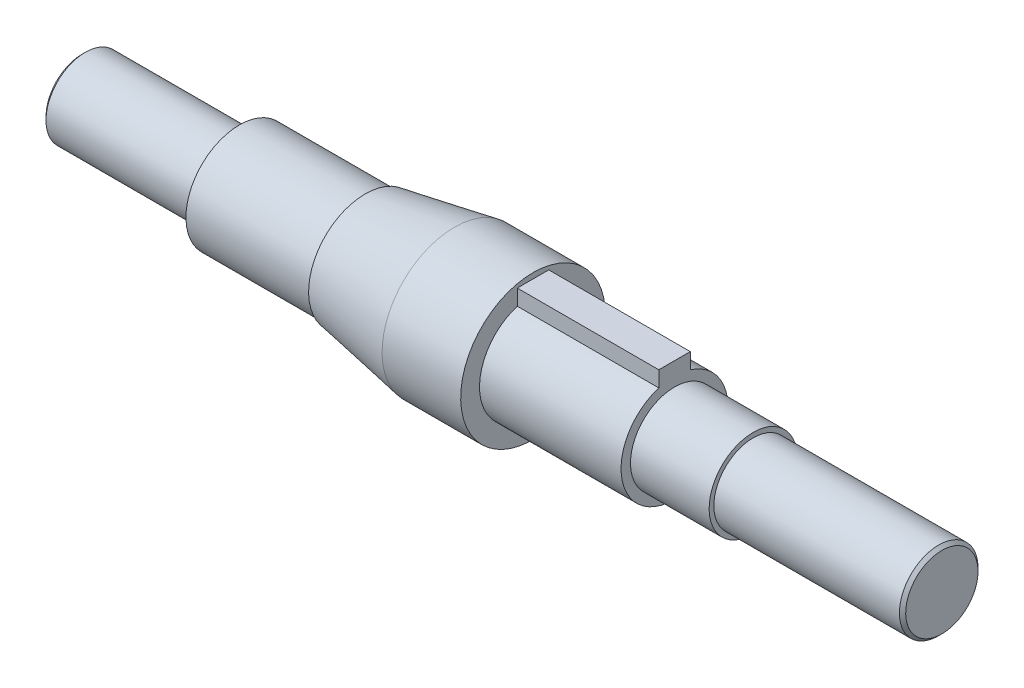
ISO-10303-21;
HEADER;
FILE_DESCRIPTION(('STEP AP214'),'2;1');
FILE_NAME('part.step','',(''),(''),'','','');
FILE_SCHEMA(('AUTOMOTIVE_DESIGN { 1 0 10303 214 1 1 1 1 }'));
ENDSEC;
DATA;
#1=APPLICATION_CONTEXT('core data for automotive mechanical design processes');
#2=APPLICATION_PROTOCOL_DEFINITION('international standard','automotive_design',2000,#1);
#3=PRODUCT_CONTEXT('',#1,'mechanical');
#4=PRODUCT('Part','Part','',(#3));
#5=PRODUCT_RELATED_PRODUCT_CATEGORY('part','',(#4));
#6=PRODUCT_DEFINITION_FORMATION('','',#4);
#7=PRODUCT_DEFINITION_CONTEXT('part definition',#1,'design');
#8=PRODUCT_DEFINITION('design','',#6,#7);
#9=PRODUCT_DEFINITION_SHAPE('','',#8);
#10=(LENGTH_UNIT() NAMED_UNIT(*) SI_UNIT(.MILLI.,.METRE.));
#11=(NAMED_UNIT(*) PLANE_ANGLE_UNIT() SI_UNIT($,.RADIAN.));
#12=(NAMED_UNIT(*) SI_UNIT($,.STERADIAN.) SOLID_ANGLE_UNIT());
#13=UNCERTAINTY_MEASURE_WITH_UNIT(LENGTH_MEASURE(1.E-05),#10,'distance_accuracy_value','');
#14=(GEOMETRIC_REPRESENTATION_CONTEXT(3) GLOBAL_UNCERTAINTY_ASSIGNED_CONTEXT((#13)) GLOBAL_UNIT_ASSIGNED_CONTEXT((#10,
#11,#12)) REPRESENTATION_CONTEXT('',''));
#15=CARTESIAN_POINT('',(0.,0.,0.));
#16=DIRECTION('',(0.,0.,1.));
#17=DIRECTION('',(1.,0.,0.));
#18=AXIS2_PLACEMENT_3D('',#15,#16,#17);
#19=CARTESIAN_POINT('',(-136.678204549044,0.,0.));
#20=DIRECTION('',(-1.,0.,0.));
#21=DIRECTION('',(0.,-1.,0.));
#22=AXIS2_PLACEMENT_3D('',#19,#20,#21);
#23=PLANE('',#22);
#24=CARTESIAN_POINT('',(-136.678204549044,0.,0.));
#25=DIRECTION('',(-1.,0.,0.));
#26=DIRECTION('',(0.,-1.,0.));
#27=AXIS2_PLACEMENT_3D('',#24,#25,#26);
#28=CIRCLE('',#27,11.5000000000001);
#29=CARTESIAN_POINT('',(-136.678204549044,-11.5,0.));
#30=VERTEX_POINT('',#29);
#31=EDGE_CURVE('E11',#30,#30,#28,.T.);
#32=ORIENTED_EDGE('',*,*,#31,.T.);
#33=EDGE_LOOP('',(#32));
#34=FACE_BOUND('',#33,.T.);
#35=ADVANCED_FACE('F41',(#34),#23,.T.);
#36=CARTESIAN_POINT('',(136.678204549044,0.,0.));
#37=DIRECTION('',(1.,0.,0.));
#38=DIRECTION('',(0.,1.,0.));
#39=AXIS2_PLACEMENT_3D('',#36,#37,#38);
#40=CYLINDRICAL_SURFACE('',#39,12.5);
#41=CARTESIAN_POINT('',(-135.678204549044,0.,0.));
#42=DIRECTION('',(-1.,0.,0.));
#43=DIRECTION('',(0.,-1.,0.));
#44=AXIS2_PLACEMENT_3D('',#41,#42,#43);
#45=CIRCLE('',#44,12.5);
#46=CARTESIAN_POINT('',(-135.678204549044,-12.5,0.));
#47=VERTEX_POINT('',#46);
#48=EDGE_CURVE('E51',#47,#47,#45,.F.);
#49=ORIENTED_EDGE('',*,*,#48,.T.);
#50=EDGE_LOOP('',(#49));
#51=FACE_BOUND('',#50,.T.);
#52=CARTESIAN_POINT('',(-86.6782045490442,0.,0.));
#53=DIRECTION('',(1.,0.,0.));
#54=DIRECTION('',(0.,1.,0.));
#55=AXIS2_PLACEMENT_3D('',#52,#53,#54);
#56=CIRCLE('',#55,12.5);
#57=CARTESIAN_POINT('',(-86.6782045490442,12.5,0.));
#58=VERTEX_POINT('',#57);
#59=EDGE_CURVE('E137',#58,#58,#56,.T.);
#60=ORIENTED_EDGE('',*,*,#59,.F.);
#61=EDGE_LOOP('',(#60));
#62=FACE_BOUND('',#61,.T.);
#63=ADVANCED_FACE('F152',(#51,#62),#40,.T.);
#64=CARTESIAN_POINT('',(-86.6782045490442,12.5,0.));
#65=DIRECTION('',(-1.,0.,0.));
#66=DIRECTION('',(0.,-1.,0.));
#67=AXIS2_PLACEMENT_3D('',#64,#65,#66);
#68=PLANE('',#67);
#69=ORIENTED_EDGE('',*,*,#59,.T.);
#70=EDGE_LOOP('',(#69));
#71=FACE_BOUND('',#70,.T.);
#72=CARTESIAN_POINT('',(-86.6782045490442,0.,0.));
#73=DIRECTION('',(1.,0.,0.));
#74=DIRECTION('',(0.,1.,0.));
#75=AXIS2_PLACEMENT_3D('',#72,#73,#74);
#76=CIRCLE('',#75,16.9999999999999);
#77=CARTESIAN_POINT('',(-86.6782045490442,17.,0.));
#78=VERTEX_POINT('',#77);
#79=EDGE_CURVE('E133',#78,#78,#76,.T.);
#80=ORIENTED_EDGE('',*,*,#79,.F.);
#81=EDGE_LOOP('',(#80));
#82=FACE_BOUND('',#81,.T.);
#83=ADVANCED_FACE('F169',(#71,#82),#68,.T.);
#84=CARTESIAN_POINT('',(136.678204549044,0.,0.));
#85=DIRECTION('',(1.,0.,0.));
#86=DIRECTION('',(0.,1.,0.));
#87=AXIS2_PLACEMENT_3D('',#84,#85,#86);
#88=CYLINDRICAL_SURFACE('',#87,16.9999999999999);
#89=ORIENTED_EDGE('',*,*,#79,.T.);
#90=EDGE_LOOP('',(#89));
#91=FACE_BOUND('',#90,.T.);
#92=CARTESIAN_POINT('',(-46.6782045490442,0.,0.));
#93=DIRECTION('',(1.,0.,0.));
#94=DIRECTION('',(0.,1.,0.));
#95=AXIS2_PLACEMENT_3D('',#92,#93,#94);
#96=CIRCLE('',#95,16.9999999999999);
#97=CARTESIAN_POINT('',(-46.6782045490442,17.,0.));
#98=VERTEX_POINT('',#97);
#99=EDGE_CURVE('E129',#98,#98,#96,.T.);
#100=ORIENTED_EDGE('',*,*,#99,.F.);
#101=EDGE_LOOP('',(#100));
#102=FACE_BOUND('',#101,.T.);
#103=ADVANCED_FACE('F179',(#91,#102),#88,.T.);
#104=CARTESIAN_POINT('',(-46.6782045490442,17.,0.));
#105=DIRECTION('',(-1.,0.,0.));
#106=DIRECTION('',(0.,-1.,0.));
#107=AXIS2_PLACEMENT_3D('',#104,#105,#106);
#108=PLANE('',#107);
#109=ORIENTED_EDGE('',*,*,#99,.T.);
#110=EDGE_LOOP('',(#109));
#111=FACE_BOUND('',#110,.T.);
#112=CARTESIAN_POINT('',(-46.6782045490442,0.,0.));
#113=DIRECTION('',(1.,0.,0.));
#114=DIRECTION('',(0.,1.,0.));
#115=AXIS2_PLACEMENT_3D('',#112,#113,#114);
#116=CIRCLE('',#115,18.);
#117=CARTESIAN_POINT('',(-46.6782045490442,18.,0.));
#118=VERTEX_POINT('',#117);
#119=EDGE_CURVE('E125',#118,#118,#116,.T.);
#120=ORIENTED_EDGE('',*,*,#119,.F.);
#121=EDGE_LOOP('',(#120));
#122=FACE_BOUND('',#121,.T.);
#123=ADVANCED_FACE('F183',(#111,#122),#108,.T.);
#124=CARTESIAN_POINT('',(-18.3217954509558,0.,0.));
#125=DIRECTION('',(1.,0.,0.));
#126=DIRECTION('',(0.,1.,0.));
#127=AXIS2_PLACEMENT_3D('',#124,#125,#126);
#128=CONICAL_SURFACE('',#127,23.,0.174532925199434);
#129=ORIENTED_EDGE('',*,*,#119,.T.);
#130=EDGE_LOOP('',(#129));
#131=FACE_BOUND('',#130,.T.);
#132=CARTESIAN_POINT('',(-18.3217954509558,0.,0.));
#133=DIRECTION('',(1.,0.,0.));
#134=DIRECTION('',(0.,1.,0.));
#135=AXIS2_PLACEMENT_3D('',#132,#133,#134);
#136=CIRCLE('',#135,23.);
#137=CARTESIAN_POINT('',(-18.3217954509558,23.,0.));
#138=VERTEX_POINT('',#137);
#139=EDGE_CURVE('E121',#138,#138,#136,.T.);
#140=ORIENTED_EDGE('',*,*,#139,.F.);
#141=EDGE_LOOP('',(#140));
#142=FACE_BOUND('',#141,.T.);
#143=ADVANCED_FACE('F187',(#131,#142),#128,.T.);
#144=CARTESIAN_POINT('',(136.678204549044,0.,0.));
#145=DIRECTION('',(1.,0.,0.));
#146=DIRECTION('',(0.,1.,0.));
#147=AXIS2_PLACEMENT_3D('',#144,#145,#146);
#148=CYLINDRICAL_SURFACE('',#147,23.);
#149=ORIENTED_EDGE('',*,*,#139,.T.);
#150=EDGE_LOOP('',(#149));
#151=FACE_BOUND('',#150,.T.);
#152=CARTESIAN_POINT('',(6.67820454904422,0.,0.));
#153=DIRECTION('',(1.,0.,0.));
#154=DIRECTION('',(0.,1.,0.));
#155=AXIS2_PLACEMENT_3D('',#152,#153,#154);
#156=CIRCLE('',#155,23.);
#157=CARTESIAN_POINT('',(6.67820454904422,23.,0.));
#158=VERTEX_POINT('',#157);
#159=EDGE_CURVE('E111',#158,#158,#156,.T.);
#160=ORIENTED_EDGE('',*,*,#159,.F.);
#161=EDGE_LOOP('',(#160));
#162=FACE_BOUND('',#161,.T.);
#163=ADVANCED_FACE('F191',(#151,#162),#148,.T.);
#164=CARTESIAN_POINT('',(6.67820454904423,23.,0.));
#165=DIRECTION('',(1.,0.,0.));
#166=DIRECTION('',(0.,1.,0.));
#167=AXIS2_PLACEMENT_3D('',#164,#165,#166);
#168=PLANE('',#167);
#169=DIRECTION('',(0.,1.,0.));
#170=VECTOR('',#169,1.);
#171=CARTESIAN_POINT('',(6.67820454904423,21.2480768092719,5.));
#172=LINE('',#171,#170);
#173=CARTESIAN_POINT('',(6.67820454904423,16.2480768092719,5.));
#174=VERTEX_POINT('',#173);
#175=CARTESIAN_POINT('',(6.67820454904423,21.2480768092719,5.));
#176=VERTEX_POINT('',#175);
#177=EDGE_CURVE('E237',#174,#176,#172,.T.);
#178=ORIENTED_EDGE('',*,*,#177,.T.);
#179=DIRECTION('',(0.,0.,-1.));
#180=VECTOR('',#179,1.);
#181=CARTESIAN_POINT('',(6.67820454904423,21.2480768092719,5.));
#182=LINE('',#181,#180);
#183=CARTESIAN_POINT('',(6.67820454904423,21.2480768092719,-5.));
#184=VERTEX_POINT('',#183);
#185=EDGE_CURVE('E232',#176,#184,#182,.T.);
#186=ORIENTED_EDGE('',*,*,#185,.T.);
#187=DIRECTION('',(0.,-1.,0.));
#188=VECTOR('',#187,1.);
#189=CARTESIAN_POINT('',(6.67820454904423,21.2480768092719,-5.));
#190=LINE('',#189,#188);
#191=CARTESIAN_POINT('',(6.67820454904423,16.2480768092719,-5.));
#192=VERTEX_POINT('',#191);
#193=EDGE_CURVE('E67',#184,#192,#190,.T.);
#194=ORIENTED_EDGE('',*,*,#193,.T.);
#195=CARTESIAN_POINT('',(6.67820454904422,0.,0.));
#196=DIRECTION('',(1.,0.,0.));
#197=DIRECTION('',(0.,1.,0.));
#198=AXIS2_PLACEMENT_3D('',#195,#196,#197);
#199=CIRCLE('',#198,17.);
#200=EDGE_CURVE('E100',#174,#192,#199,.T.);
#201=ORIENTED_EDGE('',*,*,#200,.F.);
#202=EDGE_LOOP('',(#178,#186,#194,#201));
#203=FACE_BOUND('',#202,.T.);
#204=ORIENTED_EDGE('',*,*,#159,.T.);
#205=EDGE_LOOP('',(#204));
#206=FACE_BOUND('',#205,.T.);
#207=ADVANCED_FACE('F195',(#203,#206),#168,.T.);
#208=CARTESIAN_POINT('',(136.678204549044,0.,0.));
#209=DIRECTION('',(1.,0.,0.));
#210=DIRECTION('',(0.,1.,0.));
#211=AXIS2_PLACEMENT_3D('',#208,#209,#210);
#212=CYLINDRICAL_SURFACE('',#211,17.);
#213=DIRECTION('',(1.,0.,0.));
#214=VECTOR('',#213,1.);
#215=CARTESIAN_POINT('',(-4.50213533845473,16.2480768092719,-5.));
#216=LINE('',#215,#214);
#217=CARTESIAN_POINT('',(51.6782045490442,16.2480768092719,-5.));
#218=VERTEX_POINT('',#217);
#219=EDGE_CURVE('E87',#192,#218,#216,.T.);
#220=ORIENTED_EDGE('',*,*,#219,.T.);
#221=CARTESIAN_POINT('',(51.6782045490442,0.,0.));
#222=DIRECTION('',(1.,0.,0.));
#223=DIRECTION('',(0.,1.,0.));
#224=AXIS2_PLACEMENT_3D('',#221,#222,#223);
#225=CIRCLE('',#224,17.);
#226=CARTESIAN_POINT('',(51.6782045490442,16.2480768092719,4.99999999999996));
#227=VERTEX_POINT('',#226);
#228=EDGE_CURVE('E98',#227,#218,#225,.T.);
#229=ORIENTED_EDGE('',*,*,#228,.F.);
#230=DIRECTION('',(1.,0.,0.));
#231=VECTOR('',#230,1.);
#232=CARTESIAN_POINT('',(-4.50213533845473,16.2480768092719,5.));
#233=LINE('',#232,#231);
#234=EDGE_CURVE('E102',#174,#227,#233,.T.);
#235=ORIENTED_EDGE('',*,*,#234,.F.);
#236=ORIENTED_EDGE('',*,*,#200,.T.);
#237=EDGE_LOOP('',(#220,#229,#235,#236));
#238=FACE_BOUND('',#237,.T.);
#239=ADVANCED_FACE('F96',(#238),#212,.T.);
#240=CARTESIAN_POINT('',(51.6782045490442,17.,0.));
#241=DIRECTION('',(1.,0.,0.));
#242=DIRECTION('',(0.,1.,0.));
#243=AXIS2_PLACEMENT_3D('',#240,#241,#242);
#244=PLANE('',#243);
#245=ORIENTED_EDGE('',*,*,#228,.T.);
#246=DIRECTION('',(0.,1.,0.));
#247=VECTOR('',#246,1.);
#248=CARTESIAN_POINT('',(51.6782045490442,21.2480768092719,-5.));
#249=LINE('',#248,#247);
#250=CARTESIAN_POINT('',(51.6782045490442,21.2480768092719,-5.));
#251=VERTEX_POINT('',#250);
#252=EDGE_CURVE('E84',#218,#251,#249,.T.);
#253=ORIENTED_EDGE('',*,*,#252,.T.);
#254=DIRECTION('',(0.,0.,1.));
#255=VECTOR('',#254,1.);
#256=CARTESIAN_POINT('',(51.6782045490442,21.2480768092719,5.));
#257=LINE('',#256,#255);
#258=CARTESIAN_POINT('',(51.6782045490442,21.2480768092719,5.));
#259=VERTEX_POINT('',#258);
#260=EDGE_CURVE('E91',#251,#259,#257,.T.);
#261=ORIENTED_EDGE('',*,*,#260,.T.);
#262=DIRECTION('',(0.,-1.,0.));
#263=VECTOR('',#262,1.);
#264=CARTESIAN_POINT('',(51.6782045490442,21.2480768092719,5.));
#265=LINE('',#264,#263);
#266=EDGE_CURVE('E58',#259,#227,#265,.T.);
#267=ORIENTED_EDGE('',*,*,#266,.T.);
#268=EDGE_LOOP('',(#245,#253,#261,#267));
#269=FACE_BOUND('',#268,.T.);
#270=CARTESIAN_POINT('',(51.6782045490442,0.,0.));
#271=DIRECTION('',(1.,0.,0.));
#272=DIRECTION('',(0.,1.,0.));
#273=AXIS2_PLACEMENT_3D('',#270,#271,#272);
#274=CIRCLE('',#273,14.);
#275=CARTESIAN_POINT('',(51.6782045490442,14.,0.));
#276=VERTEX_POINT('',#275);
#277=EDGE_CURVE('E107',#276,#276,#274,.T.);
#278=ORIENTED_EDGE('',*,*,#277,.F.);
#279=EDGE_LOOP('',(#278));
#280=FACE_BOUND('',#279,.T.);
#281=ADVANCED_FACE('F104',(#269,#280),#244,.T.);
#282=CARTESIAN_POINT('',(136.678204549044,0.,0.));
#283=DIRECTION('',(1.,0.,0.));
#284=DIRECTION('',(0.,1.,0.));
#285=AXIS2_PLACEMENT_3D('',#282,#283,#284);
#286=CYLINDRICAL_SURFACE('',#285,14.);
#287=ORIENTED_EDGE('',*,*,#277,.T.);
#288=EDGE_LOOP('',(#287));
#289=FACE_BOUND('',#288,.T.);
#290=CARTESIAN_POINT('',(76.6782045490442,0.,0.));
#291=DIRECTION('',(1.,0.,0.));
#292=DIRECTION('',(0.,1.,0.));
#293=AXIS2_PLACEMENT_3D('',#290,#291,#292);
#294=CIRCLE('',#293,14.);
#295=CARTESIAN_POINT('',(76.6782045490442,14.,0.));
#296=VERTEX_POINT('',#295);
#297=EDGE_CURVE('E114',#296,#296,#294,.T.);
#298=ORIENTED_EDGE('',*,*,#297,.F.);
#299=EDGE_LOOP('',(#298));
#300=FACE_BOUND('',#299,.T.);
#301=ADVANCED_FACE('F204',(#289,#300),#286,.T.);
#302=CARTESIAN_POINT('',(76.6782045490442,14.,0.));
#303=DIRECTION('',(1.,0.,0.));
#304=DIRECTION('',(0.,1.,0.));
#305=AXIS2_PLACEMENT_3D('',#302,#303,#304);
#306=PLANE('',#305);
#307=ORIENTED_EDGE('',*,*,#297,.T.);
#308=EDGE_LOOP('',(#307));
#309=FACE_BOUND('',#308,.T.);
#310=CARTESIAN_POINT('',(76.6782045490442,0.,0.));
#311=DIRECTION('',(1.,0.,0.));
#312=DIRECTION('',(0.,1.,0.));
#313=AXIS2_PLACEMENT_3D('',#310,#311,#312);
#314=CIRCLE('',#313,12.5);
#315=CARTESIAN_POINT('',(76.6782045490442,12.5000000000001,0.));
#316=VERTEX_POINT('',#315);
#317=EDGE_CURVE('E243',#316,#316,#314,.T.);
#318=ORIENTED_EDGE('',*,*,#317,.F.);
#319=EDGE_LOOP('',(#318));
#320=FACE_BOUND('',#319,.T.);
#321=ADVANCED_FACE('F207',(#309,#320),#306,.T.);
#322=CARTESIAN_POINT('',(136.678204549044,0.,0.));
#323=DIRECTION('',(1.,0.,0.));
#324=DIRECTION('',(0.,1.,0.));
#325=AXIS2_PLACEMENT_3D('',#322,#323,#324);
#326=CYLINDRICAL_SURFACE('',#325,12.5);
#327=CARTESIAN_POINT('',(135.678204549044,0.,0.));
#328=DIRECTION('',(1.,0.,0.));
#329=DIRECTION('',(0.,1.,0.));
#330=AXIS2_PLACEMENT_3D('',#327,#328,#329);
#331=CIRCLE('',#330,12.5);
#332=CARTESIAN_POINT('',(135.678204549044,12.5000000000001,0.));
#333=VERTEX_POINT('',#332);
#334=EDGE_CURVE('E145',#333,#333,#331,.F.);
#335=ORIENTED_EDGE('',*,*,#334,.T.);
#336=EDGE_LOOP('',(#335));
#337=FACE_BOUND('',#336,.T.);
#338=ORIENTED_EDGE('',*,*,#317,.T.);
#339=EDGE_LOOP('',(#338));
#340=FACE_BOUND('',#339,.T.);
#341=ADVANCED_FACE('F211',(#337,#340),#326,.T.);
#342=CARTESIAN_POINT('',(136.678204549044,12.5,0.));
#343=DIRECTION('',(1.,0.,0.));
#344=DIRECTION('',(0.,1.,0.));
#345=AXIS2_PLACEMENT_3D('',#342,#343,#344);
#346=PLANE('',#345);
#347=CARTESIAN_POINT('',(136.678204549044,0.,0.));
#348=DIRECTION('',(1.,0.,0.));
#349=DIRECTION('',(0.,1.,0.));
#350=AXIS2_PLACEMENT_3D('',#347,#348,#349);
#351=CIRCLE('',#350,11.5);
#352=CARTESIAN_POINT('',(136.678204549044,11.5,0.));
#353=VERTEX_POINT('',#352);
#354=EDGE_CURVE('E141',#353,#353,#351,.T.);
#355=ORIENTED_EDGE('',*,*,#354,.T.);
#356=EDGE_LOOP('',(#355));
#357=FACE_BOUND('',#356,.T.);
#358=ADVANCED_FACE('F215',(#357),#346,.T.);
#359=CARTESIAN_POINT('',(-4.50213533845473,21.2480768092719,5.));
#360=DIRECTION('',(0.,0.,1.));
#361=DIRECTION('',(1.,0.,0.));
#362=AXIS2_PLACEMENT_3D('',#359,#360,#361);
#363=PLANE('',#362);
#364=ORIENTED_EDGE('',*,*,#177,.F.);
#365=ORIENTED_EDGE('',*,*,#234,.T.);
#366=ORIENTED_EDGE('',*,*,#266,.F.);
#367=DIRECTION('',(1.,0.,0.));
#368=VECTOR('',#367,1.);
#369=CARTESIAN_POINT('',(-4.50213533845473,21.2480768092719,5.));
#370=LINE('',#369,#368);
#371=EDGE_CURVE('E234',#176,#259,#370,.T.);
#372=ORIENTED_EDGE('',*,*,#371,.F.);
#373=EDGE_LOOP('',(#364,#365,#366,#372));
#374=FACE_BOUND('',#373,.T.);
#375=ADVANCED_FACE('F219',(#374),#363,.T.);
#376=CARTESIAN_POINT('',(-4.50213533845473,21.2480768092719,5.));
#377=DIRECTION('',(0.,1.,0.));
#378=DIRECTION('',(0.,0.,1.));
#379=AXIS2_PLACEMENT_3D('',#376,#377,#378);
#380=PLANE('',#379);
#381=ORIENTED_EDGE('',*,*,#185,.F.);
#382=ORIENTED_EDGE('',*,*,#371,.T.);
#383=ORIENTED_EDGE('',*,*,#260,.F.);
#384=DIRECTION('',(1.,0.,0.));
#385=VECTOR('',#384,1.);
#386=CARTESIAN_POINT('',(-4.50213533845473,21.2480768092719,-5.));
#387=LINE('',#386,#385);
#388=EDGE_CURVE('E88',#184,#251,#387,.T.);
#389=ORIENTED_EDGE('',*,*,#388,.F.);
#390=EDGE_LOOP('',(#381,#382,#383,#389));
#391=FACE_BOUND('',#390,.T.);
#392=ADVANCED_FACE('F223',(#391),#380,.T.);
#393=CARTESIAN_POINT('',(-4.50213533845473,21.2480768092719,-5.));
#394=DIRECTION('',(0.,0.,-1.));
#395=DIRECTION('',(0.,1.,0.));
#396=AXIS2_PLACEMENT_3D('',#393,#394,#395);
#397=PLANE('',#396);
#398=ORIENTED_EDGE('',*,*,#193,.F.);
#399=ORIENTED_EDGE('',*,*,#388,.T.);
#400=ORIENTED_EDGE('',*,*,#252,.F.);
#401=ORIENTED_EDGE('',*,*,#219,.F.);
#402=EDGE_LOOP('',(#398,#399,#400,#401));
#403=FACE_BOUND('',#402,.T.);
#404=ADVANCED_FACE('F86',(#403),#397,.T.);
#405=CARTESIAN_POINT('',(136.678204549044,0.,0.));
#406=DIRECTION('',(-1.,0.,0.));
#407=DIRECTION('',(0.,-1.,0.));
#408=AXIS2_PLACEMENT_3D('',#405,#406,#407);
#409=CONICAL_SURFACE('',#408,11.5,0.785398163397451);
#410=ORIENTED_EDGE('',*,*,#334,.F.);
#411=EDGE_LOOP('',(#410));
#412=FACE_BOUND('',#411,.T.);
#413=ORIENTED_EDGE('',*,*,#354,.F.);
#414=EDGE_LOOP('',(#413));
#415=FACE_BOUND('',#414,.T.);
#416=ADVANCED_FACE('F156',(#412,#415),#409,.T.);
#417=CARTESIAN_POINT('',(-135.678204549044,0.,0.));
#418=DIRECTION('',(1.,0.,0.));
#419=DIRECTION('',(0.,1.,0.));
#420=AXIS2_PLACEMENT_3D('',#417,#418,#419);
#421=CONICAL_SURFACE('',#420,12.5,0.785398163397465);
#422=ORIENTED_EDGE('',*,*,#31,.F.);
#423=EDGE_LOOP('',(#422));
#424=FACE_BOUND('',#423,.T.);
#425=ORIENTED_EDGE('',*,*,#48,.F.);
#426=EDGE_LOOP('',(#425));
#427=FACE_BOUND('',#426,.T.);
#428=ADVANCED_FACE('F44',(#424,#427),#421,.T.);
#429=CLOSED_SHELL('',(#35,#63,#83,#103,#123,#143,#163,#207,#239,#281,#301,#321,#341,#358,#375,
#392,#404,#416,#428));
#430=MANIFOLD_SOLID_BREP('B2',#429);
#431=ADVANCED_BREP_SHAPE_REPRESENTATION('',(#18,#430),#14);
#432=SHAPE_DEFINITION_REPRESENTATION(#9,#431);
ENDSEC;
END-ISO-10303-21;
